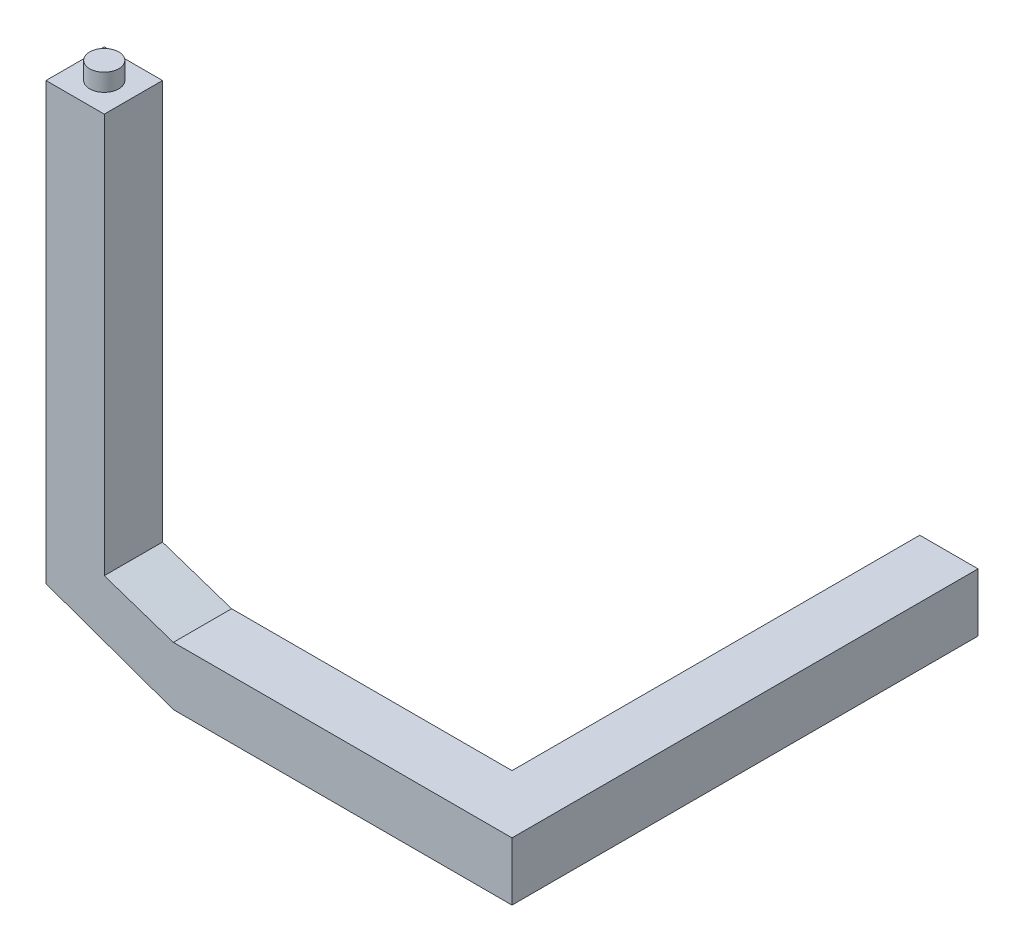
ISO-10303-21;
HEADER;
FILE_DESCRIPTION(('STEP AP214'),'2;1');
FILE_NAME('part.step','',(''),(''),'','','');
FILE_SCHEMA(('AUTOMOTIVE_DESIGN { 1 0 10303 214 1 1 1 1 }'));
ENDSEC;
DATA;
#1=APPLICATION_CONTEXT('core data for automotive mechanical design processes');
#2=APPLICATION_PROTOCOL_DEFINITION('international standard','automotive_design',2000,#1);
#3=PRODUCT_CONTEXT('',#1,'mechanical');
#4=PRODUCT('Part','Part','',(#3));
#5=PRODUCT_RELATED_PRODUCT_CATEGORY('part','',(#4));
#6=PRODUCT_DEFINITION_FORMATION('','',#4);
#7=PRODUCT_DEFINITION_CONTEXT('part definition',#1,'design');
#8=PRODUCT_DEFINITION('design','',#6,#7);
#9=PRODUCT_DEFINITION_SHAPE('','',#8);
#10=(LENGTH_UNIT() NAMED_UNIT(*) SI_UNIT(.MILLI.,.METRE.));
#11=(NAMED_UNIT(*) PLANE_ANGLE_UNIT() SI_UNIT($,.RADIAN.));
#12=(NAMED_UNIT(*) SI_UNIT($,.STERADIAN.) SOLID_ANGLE_UNIT());
#13=UNCERTAINTY_MEASURE_WITH_UNIT(LENGTH_MEASURE(1.E-05),#10,'distance_accuracy_value','');
#14=(GEOMETRIC_REPRESENTATION_CONTEXT(3) GLOBAL_UNCERTAINTY_ASSIGNED_CONTEXT((#13)) GLOBAL_UNIT_ASSIGNED_CONTEXT((#10,
#11,#12)) REPRESENTATION_CONTEXT('',''));
#15=CARTESIAN_POINT('',(0.,0.,0.));
#16=DIRECTION('',(0.,0.,1.));
#17=DIRECTION('',(1.,0.,0.));
#18=AXIS2_PLACEMENT_3D('',#15,#16,#17);
#19=CARTESIAN_POINT('',(0.,0.,0.));
#20=DIRECTION('',(0.,0.,1.));
#21=DIRECTION('',(1.,0.,0.));
#22=AXIS2_PLACEMENT_3D('',#19,#20,#21);
#23=PLANE('',#22);
#24=DIRECTION('',(0.,-1.,0.));
#25=VECTOR('',#24,1.);
#26=CARTESIAN_POINT('',(0.,100.,0.));
#27=LINE('',#26,#25);
#28=CARTESIAN_POINT('',(0.,100.,0.));
#29=VERTEX_POINT('',#28);
#30=CARTESIAN_POINT('',(0.,0.,0.));
#31=VERTEX_POINT('',#30);
#32=EDGE_CURVE('E152',#29,#31,#27,.T.);
#33=ORIENTED_EDGE('',*,*,#32,.F.);
#34=DIRECTION('',(-1.,0.,0.));
#35=VECTOR('',#34,1.);
#36=CARTESIAN_POINT('',(100.,100.,0.));
#37=LINE('',#36,#35);
#38=CARTESIAN_POINT('',(100.,100.,0.));
#39=VERTEX_POINT('',#38);
#40=EDGE_CURVE('E170',#39,#29,#37,.T.);
#41=ORIENTED_EDGE('',*,*,#40,.F.);
#42=DIRECTION('',(0.,1.,0.));
#43=VECTOR('',#42,1.);
#44=CARTESIAN_POINT('',(100.,0.,0.));
#45=LINE('',#44,#43);
#46=CARTESIAN_POINT('',(100.,0.,0.));
#47=VERTEX_POINT('',#46);
#48=EDGE_CURVE('E178',#47,#39,#45,.T.);
#49=ORIENTED_EDGE('',*,*,#48,.F.);
#50=DIRECTION('',(1.,0.,0.));
#51=VECTOR('',#50,1.);
#52=CARTESIAN_POINT('',(0.,0.,0.));
#53=LINE('',#52,#51);
#54=EDGE_CURVE('E158',#31,#47,#53,.T.);
#55=ORIENTED_EDGE('',*,*,#54,.F.);
#56=EDGE_LOOP('',(#33,#41,#49,#55));
#57=FACE_BOUND('',#56,.T.);
#58=ADVANCED_FACE('F45',(#57),#23,.F.);
#59=CARTESIAN_POINT('',(100.,0.,800.));
#60=DIRECTION('',(-1.,0.,0.));
#61=DIRECTION('',(0.,0.,1.));
#62=AXIS2_PLACEMENT_3D('',#59,#60,#61);
#63=PLANE('',#62);
#64=ORIENTED_EDGE('',*,*,#48,.T.);
#65=DIRECTION('',(0.,0.,-1.));
#66=VECTOR('',#65,1.);
#67=CARTESIAN_POINT('',(100.,100.,800.));
#68=LINE('',#67,#66);
#69=CARTESIAN_POINT('',(100.,100.,800.));
#70=VERTEX_POINT('',#69);
#71=EDGE_CURVE('E185',#70,#39,#68,.T.);
#72=ORIENTED_EDGE('',*,*,#71,.F.);
#73=DIRECTION('',(0.,1.,0.));
#74=VECTOR('',#73,1.);
#75=CARTESIAN_POINT('',(100.,0.,800.));
#76=LINE('',#75,#74);
#77=CARTESIAN_POINT('',(100.,0.,800.));
#78=VERTEX_POINT('',#77);
#79=EDGE_CURVE('E169',#78,#70,#76,.T.);
#80=ORIENTED_EDGE('',*,*,#79,.F.);
#81=DIRECTION('',(0.,0.,-1.));
#82=VECTOR('',#81,1.);
#83=CARTESIAN_POINT('',(100.,0.,800.));
#84=LINE('',#83,#82);
#85=EDGE_CURVE('E189',#78,#47,#84,.T.);
#86=ORIENTED_EDGE('',*,*,#85,.T.);
#87=EDGE_LOOP('',(#64,#72,#80,#86));
#88=FACE_BOUND('',#87,.T.);
#89=ADVANCED_FACE('F271',(#88),#63,.F.);
#90=CARTESIAN_POINT('',(0.,100.,800.));
#91=DIRECTION('',(1.,0.,0.));
#92=DIRECTION('',(0.,1.,0.));
#93=AXIS2_PLACEMENT_3D('',#90,#91,#92);
#94=PLANE('',#93);
#95=DIRECTION('',(0.,0.,-1.));
#96=VECTOR('',#95,1.);
#97=CARTESIAN_POINT('',(0.,0.,800.));
#98=LINE('',#97,#96);
#99=CARTESIAN_POINT('',(0.,0.,700.));
#100=VERTEX_POINT('',#99);
#101=EDGE_CURVE('E192',#100,#31,#98,.T.);
#102=ORIENTED_EDGE('',*,*,#101,.F.);
#103=DIRECTION('',(0.,1.,0.));
#104=VECTOR('',#103,1.);
#105=CARTESIAN_POINT('',(0.,100.,700.));
#106=LINE('',#105,#104);
#107=CARTESIAN_POINT('',(0.,100.,700.));
#108=VERTEX_POINT('',#107);
#109=EDGE_CURVE('E163',#100,#108,#106,.T.);
#110=ORIENTED_EDGE('',*,*,#109,.T.);
#111=DIRECTION('',(0.,0.,-1.));
#112=VECTOR('',#111,1.);
#113=CARTESIAN_POINT('',(0.,100.,800.));
#114=LINE('',#113,#112);
#115=EDGE_CURVE('E150',#108,#29,#114,.T.);
#116=ORIENTED_EDGE('',*,*,#115,.T.);
#117=ORIENTED_EDGE('',*,*,#32,.T.);
#118=EDGE_LOOP('',(#102,#110,#116,#117));
#119=FACE_BOUND('',#118,.T.);
#120=ADVANCED_FACE('F47',(#119),#94,.F.);
#121=CARTESIAN_POINT('',(100.,100.,800.));
#122=DIRECTION('',(0.,-1.,0.));
#123=DIRECTION('',(1.,0.,0.));
#124=AXIS2_PLACEMENT_3D('',#121,#122,#123);
#125=PLANE('',#124);
#126=DIRECTION('',(1.,0.,0.));
#127=VECTOR('',#126,1.);
#128=CARTESIAN_POINT('',(-700.,100.,700.));
#129=LINE('',#128,#127);
#130=CARTESIAN_POINT('',(-481.374152595676,100.000000000001,700.));
#131=VERTEX_POINT('',#130);
#132=EDGE_CURVE('E130',#131,#108,#129,.T.);
#133=ORIENTED_EDGE('',*,*,#132,.F.);
#134=DIRECTION('',(0.,0.,1.));
#135=VECTOR('',#134,1.);
#136=CARTESIAN_POINT('',(-481.374152595676,100.000000000001,700.));
#137=LINE('',#136,#135);
#138=CARTESIAN_POINT('',(-481.374152595676,99.9999999999999,800.));
#139=VERTEX_POINT('',#138);
#140=EDGE_CURVE('E139',#131,#139,#137,.T.);
#141=ORIENTED_EDGE('',*,*,#140,.T.);
#142=DIRECTION('',(-1.,0.,0.));
#143=VECTOR('',#142,1.);
#144=CARTESIAN_POINT('',(100.,100.,800.));
#145=LINE('',#144,#143);
#146=EDGE_CURVE('E173',#70,#139,#145,.T.);
#147=ORIENTED_EDGE('',*,*,#146,.F.);
#148=ORIENTED_EDGE('',*,*,#71,.T.);
#149=ORIENTED_EDGE('',*,*,#40,.T.);
#150=ORIENTED_EDGE('',*,*,#115,.F.);
#151=EDGE_LOOP('',(#133,#141,#147,#148,#149,#150));
#152=FACE_BOUND('',#151,.T.);
#153=ADVANCED_FACE('F148',(#152),#125,.F.);
#154=CARTESIAN_POINT('',(-700.,0.,0.));
#155=DIRECTION('',(-1.,0.,0.));
#156=DIRECTION('',(0.,0.,1.));
#157=AXIS2_PLACEMENT_3D('',#154,#155,#156);
#158=PLANE('',#157);
#159=DIRECTION('',(0.,1.,0.));
#160=VECTOR('',#159,1.);
#161=CARTESIAN_POINT('',(-700.,100.,700.));
#162=LINE('',#161,#160);
#163=CARTESIAN_POINT('',(-700.,77.8729357377852,700.));
#164=VERTEX_POINT('',#163);
#165=CARTESIAN_POINT('',(-700.,826.035666915766,700.));
#166=VERTEX_POINT('',#165);
#167=EDGE_CURVE('E160',#164,#166,#162,.T.);
#168=ORIENTED_EDGE('',*,*,#167,.F.);
#169=DIRECTION('',(0.,0.,1.));
#170=VECTOR('',#169,1.);
#171=CARTESIAN_POINT('',(-700.,77.8729357377852,0.));
#172=LINE('',#171,#170);
#173=CARTESIAN_POINT('',(-700.,77.8729357377852,800.));
#174=VERTEX_POINT('',#173);
#175=EDGE_CURVE('E49',#164,#174,#172,.T.);
#176=ORIENTED_EDGE('',*,*,#175,.T.);
#177=DIRECTION('',(0.,-1.,0.));
#178=VECTOR('',#177,1.);
#179=CARTESIAN_POINT('',(-700.,0.,800.));
#180=LINE('',#179,#178);
#181=CARTESIAN_POINT('',(-700.,826.035666915766,800.));
#182=VERTEX_POINT('',#181);
#183=EDGE_CURVE('E203',#182,#174,#180,.T.);
#184=ORIENTED_EDGE('',*,*,#183,.F.);
#185=DIRECTION('',(0.,0.,1.));
#186=VECTOR('',#185,1.);
#187=CARTESIAN_POINT('',(-700.,826.035666915766,700.));
#188=LINE('',#187,#186);
#189=EDGE_CURVE('E145',#166,#182,#188,.T.);
#190=ORIENTED_EDGE('',*,*,#189,.F.);
#191=EDGE_LOOP('',(#168,#176,#184,#190));
#192=FACE_BOUND('',#191,.T.);
#193=ADVANCED_FACE('F201',(#192),#158,.T.);
#194=CARTESIAN_POINT('',(-700.,100.,700.));
#195=DIRECTION('',(0.,0.,-1.));
#196=DIRECTION('',(-1.,0.,0.));
#197=AXIS2_PLACEMENT_3D('',#194,#195,#196);
#198=PLANE('',#197);
#199=DIRECTION('',(1.,0.,0.));
#200=VECTOR('',#199,1.);
#201=CARTESIAN_POINT('',(-700.,0.,700.));
#202=LINE('',#201,#200);
#203=CARTESIAN_POINT('',(-481.374152595676,0.,700.));
#204=VERTEX_POINT('',#203);
#205=EDGE_CURVE('E153',#204,#100,#202,.T.);
#206=ORIENTED_EDGE('',*,*,#205,.F.);
#207=DIRECTION('',(-0.942025077333048,0.335542476708486,0.));
#208=VECTOR('',#207,1.);
#209=CARTESIAN_POINT('',(-706.994131076444,80.3641943255693,700.));
#210=LINE('',#209,#208);
#211=EDGE_CURVE('E217',#204,#164,#210,.T.);
#212=ORIENTED_EDGE('',*,*,#211,.T.);
#213=ORIENTED_EDGE('',*,*,#167,.T.);
#214=DIRECTION('',(-1.,0.,0.));
#215=VECTOR('',#214,1.);
#216=CARTESIAN_POINT('',(-599.999999999999,826.035666915766,700.));
#217=LINE('',#216,#215);
#218=CARTESIAN_POINT('',(-599.999999999999,826.035666915766,700.));
#219=VERTEX_POINT('',#218);
#220=EDGE_CURVE('E136',#219,#166,#217,.T.);
#221=ORIENTED_EDGE('',*,*,#220,.F.);
#222=DIRECTION('',(0.,1.,0.));
#223=VECTOR('',#222,1.);
#224=CARTESIAN_POINT('',(-599.999999999999,139.764231534938,700.));
#225=LINE('',#224,#223);
#226=CARTESIAN_POINT('',(-599.999999999999,139.764231534938,700.));
#227=VERTEX_POINT('',#226);
#228=EDGE_CURVE('E134',#227,#219,#225,.T.);
#229=ORIENTED_EDGE('',*,*,#228,.F.);
#230=DIRECTION('',(0.948148954979387,-0.317826303460704,0.));
#231=VECTOR('',#230,1.);
#232=CARTESIAN_POINT('',(-599.999999999999,139.764231534938,700.));
#233=LINE('',#232,#231);
#234=EDGE_CURVE('E125',#227,#131,#233,.T.);
#235=ORIENTED_EDGE('',*,*,#234,.T.);
#236=ORIENTED_EDGE('',*,*,#132,.T.);
#237=ORIENTED_EDGE('',*,*,#109,.F.);
#238=EDGE_LOOP('',(#206,#212,#213,#221,#229,#235,#236,#237));
#239=FACE_BOUND('',#238,.T.);
#240=ADVANCED_FACE('F127',(#239),#198,.T.);
#241=CARTESIAN_POINT('',(0.,0.,800.));
#242=DIRECTION('',(0.,0.,1.));
#243=DIRECTION('',(1.,0.,0.));
#244=AXIS2_PLACEMENT_3D('',#241,#242,#243);
#245=PLANE('',#244);
#246=ORIENTED_EDGE('',*,*,#183,.T.);
#247=DIRECTION('',(0.942025077333048,-0.335542476708486,0.));
#248=VECTOR('',#247,1.);
#249=CARTESIAN_POINT('',(-700.,77.8729357377852,800.));
#250=LINE('',#249,#248);
#251=CARTESIAN_POINT('',(-481.374152595676,0.,800.));
#252=VERTEX_POINT('',#251);
#253=EDGE_CURVE('E70',#174,#252,#250,.T.);
#254=ORIENTED_EDGE('',*,*,#253,.T.);
#255=DIRECTION('',(1.,0.,0.));
#256=VECTOR('',#255,1.);
#257=CARTESIAN_POINT('',(0.,0.,800.));
#258=LINE('',#257,#256);
#259=EDGE_CURVE('E166',#252,#78,#258,.T.);
#260=ORIENTED_EDGE('',*,*,#259,.T.);
#261=ORIENTED_EDGE('',*,*,#79,.T.);
#262=ORIENTED_EDGE('',*,*,#146,.T.);
#263=DIRECTION('',(0.948148954979387,-0.317826303460704,0.));
#264=VECTOR('',#263,1.);
#265=CARTESIAN_POINT('',(-599.999999999999,139.764231534938,800.));
#266=LINE('',#265,#264);
#267=CARTESIAN_POINT('',(-599.999999999999,139.764231534938,800.));
#268=VERTEX_POINT('',#267);
#269=EDGE_CURVE('E62',#268,#139,#266,.T.);
#270=ORIENTED_EDGE('',*,*,#269,.F.);
#271=DIRECTION('',(0.,1.,0.));
#272=VECTOR('',#271,1.);
#273=CARTESIAN_POINT('',(-599.999999999999,139.764231534938,800.));
#274=LINE('',#273,#272);
#275=CARTESIAN_POINT('',(-599.999999999999,826.035666915766,800.));
#276=VERTEX_POINT('',#275);
#277=EDGE_CURVE('E137',#268,#276,#274,.T.);
#278=ORIENTED_EDGE('',*,*,#277,.T.);
#279=DIRECTION('',(-1.,0.,0.));
#280=VECTOR('',#279,1.);
#281=CARTESIAN_POINT('',(-599.999999999999,826.035666915766,800.));
#282=LINE('',#281,#280);
#283=EDGE_CURVE('E212',#276,#182,#282,.T.);
#284=ORIENTED_EDGE('',*,*,#283,.T.);
#285=EDGE_LOOP('',(#246,#254,#260,#261,#262,#270,#278,#284));
#286=FACE_BOUND('',#285,.T.);
#287=ADVANCED_FACE('F208',(#286),#245,.T.);
#288=CARTESIAN_POINT('',(0.,0.,800.));
#289=DIRECTION('',(0.,1.,0.));
#290=DIRECTION('',(0.,0.,1.));
#291=AXIS2_PLACEMENT_3D('',#288,#289,#290);
#292=PLANE('',#291);
#293=DIRECTION('',(0.,0.,1.));
#294=VECTOR('',#293,1.);
#295=CARTESIAN_POINT('',(-481.374152595676,0.,0.));
#296=LINE('',#295,#294);
#297=EDGE_CURVE('E221',#204,#252,#296,.T.);
#298=ORIENTED_EDGE('',*,*,#297,.F.);
#299=ORIENTED_EDGE('',*,*,#205,.T.);
#300=ORIENTED_EDGE('',*,*,#101,.T.);
#301=ORIENTED_EDGE('',*,*,#54,.T.);
#302=ORIENTED_EDGE('',*,*,#85,.F.);
#303=ORIENTED_EDGE('',*,*,#259,.F.);
#304=EDGE_LOOP('',(#298,#299,#300,#301,#302,#303));
#305=FACE_BOUND('',#304,.T.);
#306=ADVANCED_FACE('F285',(#305),#292,.F.);
#307=CARTESIAN_POINT('',(-700.,77.8729357377852,0.));
#308=DIRECTION('',(-0.335542476708486,-0.942025077333048,0.));
#309=DIRECTION('',(0.942025077333048,-0.335542476708486,0.));
#310=AXIS2_PLACEMENT_3D('',#307,#308,#309);
#311=PLANE('',#310);
#312=ORIENTED_EDGE('',*,*,#297,.T.);
#313=ORIENTED_EDGE('',*,*,#253,.F.);
#314=ORIENTED_EDGE('',*,*,#175,.F.);
#315=ORIENTED_EDGE('',*,*,#211,.F.);
#316=EDGE_LOOP('',(#312,#313,#314,#315));
#317=FACE_BOUND('',#316,.T.);
#318=ADVANCED_FACE('F287',(#317),#311,.T.);
#319=CARTESIAN_POINT('',(-599.999999999999,139.764231534938,700.));
#320=DIRECTION('',(-0.317826303460704,-0.948148954979388,0.));
#321=DIRECTION('',(0.948148954979388,-0.317826303460704,0.));
#322=AXIS2_PLACEMENT_3D('',#319,#320,#321);
#323=PLANE('',#322);
#324=ORIENTED_EDGE('',*,*,#269,.T.);
#325=ORIENTED_EDGE('',*,*,#140,.F.);
#326=ORIENTED_EDGE('',*,*,#234,.F.);
#327=DIRECTION('',(0.,0.,1.));
#328=VECTOR('',#327,1.);
#329=CARTESIAN_POINT('',(-599.999999999999,139.764231534938,700.));
#330=LINE('',#329,#328);
#331=EDGE_CURVE('E231',#227,#268,#330,.T.);
#332=ORIENTED_EDGE('',*,*,#331,.T.);
#333=EDGE_LOOP('',(#324,#325,#326,#332));
#334=FACE_BOUND('',#333,.T.);
#335=ADVANCED_FACE('F140',(#334),#323,.F.);
#336=CARTESIAN_POINT('',(-599.999999999999,826.035666915766,700.));
#337=DIRECTION('',(0.,1.,0.));
#338=DIRECTION('',(0.,0.,1.));
#339=AXIS2_PLACEMENT_3D('',#336,#337,#338);
#340=PLANE('',#339);
#341=CARTESIAN_POINT('',(-650.,826.035666915766,750.));
#342=DIRECTION('',(0.,1.,0.));
#343=DIRECTION('',(0.,0.,1.));
#344=AXIS2_PLACEMENT_3D('',#341,#342,#343);
#345=CIRCLE('',#344,25.);
#346=CARTESIAN_POINT('',(-650.,826.035666915766,775.));
#347=VERTEX_POINT('',#346);
#348=EDGE_CURVE('E11',#347,#347,#345,.T.);
#349=ORIENTED_EDGE('',*,*,#348,.F.);
#350=EDGE_LOOP('',(#349));
#351=FACE_BOUND('',#350,.T.);
#352=ORIENTED_EDGE('',*,*,#283,.F.);
#353=DIRECTION('',(0.,0.,1.));
#354=VECTOR('',#353,1.);
#355=CARTESIAN_POINT('',(-599.999999999999,826.035666915766,700.));
#356=LINE('',#355,#354);
#357=EDGE_CURVE('E228',#219,#276,#356,.T.);
#358=ORIENTED_EDGE('',*,*,#357,.F.);
#359=ORIENTED_EDGE('',*,*,#220,.T.);
#360=ORIENTED_EDGE('',*,*,#189,.T.);
#361=EDGE_LOOP('',(#352,#358,#359,#360));
#362=FACE_BOUND('',#361,.T.);
#363=ADVANCED_FACE('F259',(#351,#362),#340,.T.);
#364=CARTESIAN_POINT('',(-599.999999999999,139.764231534938,700.));
#365=DIRECTION('',(1.,0.,0.));
#366=DIRECTION('',(0.,0.,-1.));
#367=AXIS2_PLACEMENT_3D('',#364,#365,#366);
#368=PLANE('',#367);
#369=ORIENTED_EDGE('',*,*,#277,.F.);
#370=ORIENTED_EDGE('',*,*,#331,.F.);
#371=ORIENTED_EDGE('',*,*,#228,.T.);
#372=ORIENTED_EDGE('',*,*,#357,.T.);
#373=EDGE_LOOP('',(#369,#370,#371,#372));
#374=FACE_BOUND('',#373,.T.);
#375=ADVANCED_FACE('F255',(#374),#368,.T.);
#376=CARTESIAN_POINT('',(-650.,856.035666915766,750.));
#377=DIRECTION('',(0.,-1.,0.));
#378=DIRECTION('',(0.,0.,-1.));
#379=AXIS2_PLACEMENT_3D('',#376,#377,#378);
#380=CYLINDRICAL_SURFACE('',#379,25.);
#381=CARTESIAN_POINT('',(-650.,856.035666915766,750.));
#382=DIRECTION('',(0.,1.,0.));
#383=DIRECTION('',(0.,0.,1.));
#384=AXIS2_PLACEMENT_3D('',#381,#382,#383);
#385=CIRCLE('',#384,25.);
#386=CARTESIAN_POINT('',(-650.,856.035666915766,775.));
#387=VERTEX_POINT('',#386);
#388=EDGE_CURVE('E240',#387,#387,#385,.T.);
#389=ORIENTED_EDGE('',*,*,#388,.F.);
#390=EDGE_LOOP('',(#389));
#391=FACE_BOUND('',#390,.T.);
#392=ORIENTED_EDGE('',*,*,#348,.T.);
#393=EDGE_LOOP('',(#392));
#394=FACE_BOUND('',#393,.T.);
#395=ADVANCED_FACE('F252',(#391,#394),#380,.T.);
#396=CARTESIAN_POINT('',(-650.,856.035666915766,750.));
#397=DIRECTION('',(0.,1.,0.));
#398=DIRECTION('',(0.,0.,1.));
#399=AXIS2_PLACEMENT_3D('',#396,#397,#398);
#400=PLANE('',#399);
#401=ORIENTED_EDGE('',*,*,#388,.T.);
#402=EDGE_LOOP('',(#401));
#403=FACE_BOUND('',#402,.T.);
#404=ADVANCED_FACE('F250',(#403),#400,.T.);
#405=CLOSED_SHELL('',(#58,#89,#120,#153,#193,#240,#287,#306,#318,#335,#363,#375,#395,#404));
#406=MANIFOLD_SOLID_BREP('B2',#405);
#407=ADVANCED_BREP_SHAPE_REPRESENTATION('',(#18,#406),#14);
#408=SHAPE_DEFINITION_REPRESENTATION(#9,#407);
ENDSEC;
END-ISO-10303-21;
